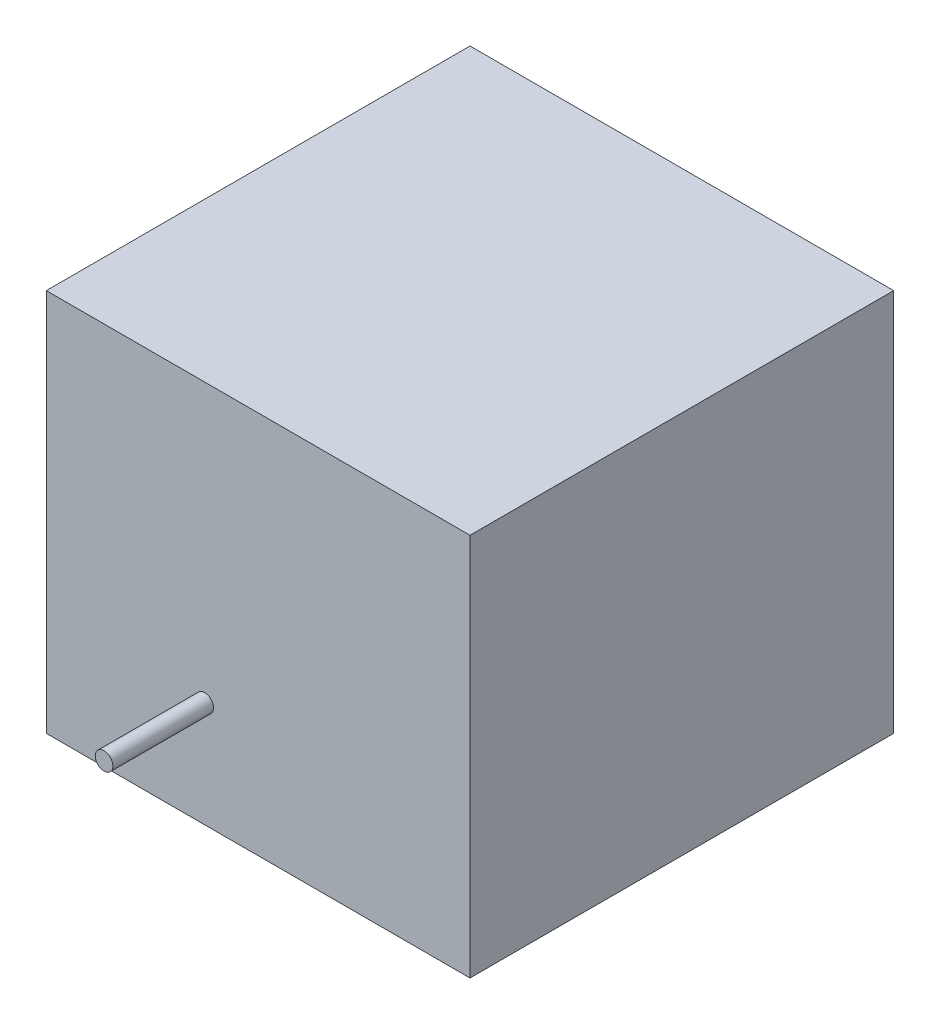
ISO-10303-21;
HEADER;
FILE_DESCRIPTION(('STEP AP214'),'2;1');
FILE_NAME('part.step','',(''),(''),'','','');
FILE_SCHEMA(('AUTOMOTIVE_DESIGN { 1 0 10303 214 1 1 1 1 }'));
ENDSEC;
DATA;
#1=APPLICATION_CONTEXT('core data for automotive mechanical design processes');
#2=APPLICATION_PROTOCOL_DEFINITION('international standard','automotive_design',2000,#1);
#3=PRODUCT_CONTEXT('',#1,'mechanical');
#4=PRODUCT('Part','Part','',(#3));
#5=PRODUCT_RELATED_PRODUCT_CATEGORY('part','',(#4));
#6=PRODUCT_DEFINITION_FORMATION('','',#4);
#7=PRODUCT_DEFINITION_CONTEXT('part definition',#1,'design');
#8=PRODUCT_DEFINITION('design','',#6,#7);
#9=PRODUCT_DEFINITION_SHAPE('','',#8);
#10=(LENGTH_UNIT() NAMED_UNIT(*) SI_UNIT(.MILLI.,.METRE.));
#11=(NAMED_UNIT(*) PLANE_ANGLE_UNIT() SI_UNIT($,.RADIAN.));
#12=(NAMED_UNIT(*) SI_UNIT($,.STERADIAN.) SOLID_ANGLE_UNIT());
#13=UNCERTAINTY_MEASURE_WITH_UNIT(LENGTH_MEASURE(1.E-05),#10,'distance_accuracy_value','');
#14=(GEOMETRIC_REPRESENTATION_CONTEXT(3) GLOBAL_UNCERTAINTY_ASSIGNED_CONTEXT((#13)) GLOBAL_UNIT_ASSIGNED_CONTEXT((#10,
#11,#12)) REPRESENTATION_CONTEXT('',''));
#15=CARTESIAN_POINT('',(0.,0.,0.));
#16=DIRECTION('',(0.,0.,1.));
#17=DIRECTION('',(1.,0.,0.));
#18=AXIS2_PLACEMENT_3D('',#15,#16,#17);
#19=CARTESIAN_POINT('',(0.,38.1,0.));
#20=DIRECTION('',(1.,0.,0.));
#21=DIRECTION('',(0.,0.,-1.));
#22=AXIS2_PLACEMENT_3D('',#19,#20,#21);
#23=PLANE('',#22);
#24=DIRECTION('',(0.,0.,1.));
#25=VECTOR('',#24,1.);
#26=CARTESIAN_POINT('',(0.,0.,0.));
#27=LINE('',#26,#25);
#28=CARTESIAN_POINT('',(0.,0.,-42.1));
#29=VERTEX_POINT('',#28);
#30=CARTESIAN_POINT('',(0.,0.,0.));
#31=VERTEX_POINT('',#30);
#32=EDGE_CURVE('E104',#29,#31,#27,.T.);
#33=ORIENTED_EDGE('',*,*,#32,.T.);
#34=DIRECTION('',(0.,-1.,0.));
#35=VECTOR('',#34,1.);
#36=CARTESIAN_POINT('',(0.,38.1,0.));
#37=LINE('',#36,#35);
#38=CARTESIAN_POINT('',(0.,38.1,0.));
#39=VERTEX_POINT('',#38);
#40=EDGE_CURVE('E95',#39,#31,#37,.T.);
#41=ORIENTED_EDGE('',*,*,#40,.F.);
#42=DIRECTION('',(0.,0.,1.));
#43=VECTOR('',#42,1.);
#44=CARTESIAN_POINT('',(0.,38.1,0.));
#45=LINE('',#44,#43);
#46=CARTESIAN_POINT('',(0.,38.1,-42.1));
#47=VERTEX_POINT('',#46);
#48=EDGE_CURVE('E89',#47,#39,#45,.T.);
#49=ORIENTED_EDGE('',*,*,#48,.F.);
#50=DIRECTION('',(0.,-1.,0.));
#51=VECTOR('',#50,1.);
#52=CARTESIAN_POINT('',(0.,38.1,-42.1));
#53=LINE('',#52,#51);
#54=EDGE_CURVE('E100',#47,#29,#53,.T.);
#55=ORIENTED_EDGE('',*,*,#54,.T.);
#56=EDGE_LOOP('',(#33,#41,#49,#55));
#57=FACE_BOUND('',#56,.T.);
#58=ADVANCED_FACE('F37',(#57),#23,.F.);
#59=CARTESIAN_POINT('',(0.,38.1,0.));
#60=DIRECTION('',(0.,0.,-1.));
#61=DIRECTION('',(-1.,0.,0.));
#62=AXIS2_PLACEMENT_3D('',#59,#60,#61);
#63=PLANE('',#62);
#64=CARTESIAN_POINT('',(15.74,10.5,0.));
#65=DIRECTION('',(0.,0.,-1.));
#66=DIRECTION('',(-1.,0.,0.));
#67=AXIS2_PLACEMENT_3D('',#64,#65,#66);
#68=CIRCLE('',#67,0.875000000000002);
#69=CARTESIAN_POINT('',(14.865,10.5,0.));
#70=VERTEX_POINT('',#69);
#71=EDGE_CURVE('E45',#70,#70,#68,.F.);
#72=ORIENTED_EDGE('',*,*,#71,.F.);
#73=EDGE_LOOP('',(#72));
#74=FACE_BOUND('',#73,.T.);
#75=DIRECTION('',(1.,0.,0.));
#76=VECTOR('',#75,1.);
#77=CARTESIAN_POINT('',(0.,0.,0.));
#78=LINE('',#77,#76);
#79=CARTESIAN_POINT('',(42.1,0.,0.));
#80=VERTEX_POINT('',#79);
#81=EDGE_CURVE('E94',#31,#80,#78,.T.);
#82=ORIENTED_EDGE('',*,*,#81,.T.);
#83=DIRECTION('',(0.,-1.,0.));
#84=VECTOR('',#83,1.);
#85=CARTESIAN_POINT('',(42.1,38.1,0.));
#86=LINE('',#85,#84);
#87=CARTESIAN_POINT('',(42.1,38.1,0.));
#88=VERTEX_POINT('',#87);
#89=EDGE_CURVE('E92',#88,#80,#86,.T.);
#90=ORIENTED_EDGE('',*,*,#89,.F.);
#91=DIRECTION('',(1.,0.,0.));
#92=VECTOR('',#91,1.);
#93=CARTESIAN_POINT('',(0.,38.1,0.));
#94=LINE('',#93,#92);
#95=EDGE_CURVE('E84',#39,#88,#94,.T.);
#96=ORIENTED_EDGE('',*,*,#95,.F.);
#97=ORIENTED_EDGE('',*,*,#40,.T.);
#98=EDGE_LOOP('',(#82,#90,#96,#97));
#99=FACE_BOUND('',#98,.T.);
#100=ADVANCED_FACE('F93',(#74,#99),#63,.F.);
#101=CARTESIAN_POINT('',(42.1,38.1,0.));
#102=DIRECTION('',(-1.,0.,0.));
#103=DIRECTION('',(0.,0.,1.));
#104=AXIS2_PLACEMENT_3D('',#101,#102,#103);
#105=PLANE('',#104);
#106=DIRECTION('',(0.,0.,-1.));
#107=VECTOR('',#106,1.);
#108=CARTESIAN_POINT('',(42.1,0.,0.));
#109=LINE('',#108,#107);
#110=CARTESIAN_POINT('',(42.1,0.,-42.1));
#111=VERTEX_POINT('',#110);
#112=EDGE_CURVE('E70',#80,#111,#109,.T.);
#113=ORIENTED_EDGE('',*,*,#112,.T.);
#114=DIRECTION('',(0.,-1.,0.));
#115=VECTOR('',#114,1.);
#116=CARTESIAN_POINT('',(42.1,38.1,-42.1));
#117=LINE('',#116,#115);
#118=CARTESIAN_POINT('',(42.1,38.1,-42.1));
#119=VERTEX_POINT('',#118);
#120=EDGE_CURVE('E96',#119,#111,#117,.T.);
#121=ORIENTED_EDGE('',*,*,#120,.F.);
#122=DIRECTION('',(0.,0.,-1.));
#123=VECTOR('',#122,1.);
#124=CARTESIAN_POINT('',(42.1,38.1,0.));
#125=LINE('',#124,#123);
#126=EDGE_CURVE('E87',#88,#119,#125,.T.);
#127=ORIENTED_EDGE('',*,*,#126,.F.);
#128=ORIENTED_EDGE('',*,*,#89,.T.);
#129=EDGE_LOOP('',(#113,#121,#127,#128));
#130=FACE_BOUND('',#129,.T.);
#131=ADVANCED_FACE('F98',(#130),#105,.F.);
#132=CARTESIAN_POINT('',(0.,38.1,-42.1));
#133=DIRECTION('',(0.,0.,1.));
#134=DIRECTION('',(1.,0.,0.));
#135=AXIS2_PLACEMENT_3D('',#132,#133,#134);
#136=PLANE('',#135);
#137=CARTESIAN_POINT('',(15.74,10.5,-42.1));
#138=DIRECTION('',(0.,0.,1.));
#139=DIRECTION('',(1.,0.,0.));
#140=AXIS2_PLACEMENT_3D('',#137,#138,#139);
#141=CIRCLE('',#140,0.875);
#142=CARTESIAN_POINT('',(16.615,10.5,-42.1));
#143=VERTEX_POINT('',#142);
#144=EDGE_CURVE('E11',#143,#143,#141,.F.);
#145=ORIENTED_EDGE('',*,*,#144,.F.);
#146=EDGE_LOOP('',(#145));
#147=FACE_BOUND('',#146,.T.);
#148=DIRECTION('',(-1.,0.,0.));
#149=VECTOR('',#148,1.);
#150=CARTESIAN_POINT('',(0.,0.,-42.1));
#151=LINE('',#150,#149);
#152=EDGE_CURVE('E76',#111,#29,#151,.T.);
#153=ORIENTED_EDGE('',*,*,#152,.T.);
#154=ORIENTED_EDGE('',*,*,#54,.F.);
#155=DIRECTION('',(-1.,0.,0.));
#156=VECTOR('',#155,1.);
#157=CARTESIAN_POINT('',(0.,38.1,-42.1));
#158=LINE('',#157,#156);
#159=EDGE_CURVE('E53',#119,#47,#158,.T.);
#160=ORIENTED_EDGE('',*,*,#159,.F.);
#161=ORIENTED_EDGE('',*,*,#120,.T.);
#162=EDGE_LOOP('',(#153,#154,#160,#161));
#163=FACE_BOUND('',#162,.T.);
#164=ADVANCED_FACE('F124',(#147,#163),#136,.F.);
#165=CARTESIAN_POINT('',(0.,38.1,0.));
#166=DIRECTION('',(0.,-1.,0.));
#167=DIRECTION('',(0.,0.,-1.));
#168=AXIS2_PLACEMENT_3D('',#165,#166,#167);
#169=PLANE('',#168);
#170=ORIENTED_EDGE('',*,*,#48,.T.);
#171=ORIENTED_EDGE('',*,*,#95,.T.);
#172=ORIENTED_EDGE('',*,*,#126,.T.);
#173=ORIENTED_EDGE('',*,*,#159,.T.);
#174=EDGE_LOOP('',(#170,#171,#172,#173));
#175=FACE_BOUND('',#174,.T.);
#176=ADVANCED_FACE('F85',(#175),#169,.F.);
#177=CARTESIAN_POINT('',(0.,0.,0.));
#178=DIRECTION('',(0.,-1.,0.));
#179=DIRECTION('',(0.,0.,-1.));
#180=AXIS2_PLACEMENT_3D('',#177,#178,#179);
#181=PLANE('',#180);
#182=ORIENTED_EDGE('',*,*,#32,.F.);
#183=ORIENTED_EDGE('',*,*,#152,.F.);
#184=ORIENTED_EDGE('',*,*,#112,.F.);
#185=ORIENTED_EDGE('',*,*,#81,.F.);
#186=EDGE_LOOP('',(#182,#183,#184,#185));
#187=FACE_BOUND('',#186,.T.);
#188=ADVANCED_FACE('F132',(#187),#181,.T.);
#189=CARTESIAN_POINT('',(15.74,10.5,10.));
#190=DIRECTION('',(0.,0.,-1.));
#191=DIRECTION('',(-1.,0.,0.));
#192=AXIS2_PLACEMENT_3D('',#189,#190,#191);
#193=CYLINDRICAL_SURFACE('',#192,0.875000000000002);
#194=CARTESIAN_POINT('',(15.74,10.5,10.));
#195=DIRECTION('',(0.,0.,1.));
#196=DIRECTION('',(1.,0.,0.));
#197=AXIS2_PLACEMENT_3D('',#194,#195,#196);
#198=CIRCLE('',#197,0.875000000000002);
#199=CARTESIAN_POINT('',(16.615,10.5,10.));
#200=VERTEX_POINT('',#199);
#201=EDGE_CURVE('E107',#200,#200,#198,.T.);
#202=ORIENTED_EDGE('',*,*,#201,.F.);
#203=EDGE_LOOP('',(#202));
#204=FACE_BOUND('',#203,.T.);
#205=ORIENTED_EDGE('',*,*,#71,.T.);
#206=EDGE_LOOP('',(#205));
#207=FACE_BOUND('',#206,.T.);
#208=ADVANCED_FACE('F116',(#204,#207),#193,.T.);
#209=CARTESIAN_POINT('',(15.74,10.5,10.));
#210=DIRECTION('',(0.,0.,1.));
#211=DIRECTION('',(1.,0.,0.));
#212=AXIS2_PLACEMENT_3D('',#209,#210,#211);
#213=PLANE('',#212);
#214=ORIENTED_EDGE('',*,*,#201,.T.);
#215=EDGE_LOOP('',(#214));
#216=FACE_BOUND('',#215,.T.);
#217=ADVANCED_FACE('F140',(#216),#213,.T.);
#218=CARTESIAN_POINT('',(15.74,10.5,-57.1));
#219=DIRECTION('',(0.,0.,1.));
#220=DIRECTION('',(1.,0.,0.));
#221=AXIS2_PLACEMENT_3D('',#218,#219,#220);
#222=CYLINDRICAL_SURFACE('',#221,0.875);
#223=CARTESIAN_POINT('',(15.74,10.5,-57.1));
#224=DIRECTION('',(0.,0.,-1.));
#225=DIRECTION('',(-1.,0.,0.));
#226=AXIS2_PLACEMENT_3D('',#223,#224,#225);
#227=CIRCLE('',#226,0.875);
#228=CARTESIAN_POINT('',(14.865,10.5,-57.1));
#229=VERTEX_POINT('',#228);
#230=EDGE_CURVE('E156',#229,#229,#227,.T.);
#231=ORIENTED_EDGE('',*,*,#230,.F.);
#232=EDGE_LOOP('',(#231));
#233=FACE_BOUND('',#232,.T.);
#234=ORIENTED_EDGE('',*,*,#144,.T.);
#235=EDGE_LOOP('',(#234));
#236=FACE_BOUND('',#235,.T.);
#237=ADVANCED_FACE('F144',(#233,#236),#222,.T.);
#238=CARTESIAN_POINT('',(15.74,10.5,-57.1));
#239=DIRECTION('',(0.,0.,-1.));
#240=DIRECTION('',(-1.,0.,0.));
#241=AXIS2_PLACEMENT_3D('',#238,#239,#240);
#242=PLANE('',#241);
#243=ORIENTED_EDGE('',*,*,#230,.T.);
#244=EDGE_LOOP('',(#243));
#245=FACE_BOUND('',#244,.T.);
#246=ADVANCED_FACE('F148',(#245),#242,.T.);
#247=CLOSED_SHELL('',(#58,#100,#131,#164,#176,#188,#208,#217,#237,#246));
#248=MANIFOLD_SOLID_BREP('B2',#247);
#249=ADVANCED_BREP_SHAPE_REPRESENTATION('',(#18,#248),#14);
#250=SHAPE_DEFINITION_REPRESENTATION(#9,#249);
ENDSEC;
END-ISO-10303-21;
